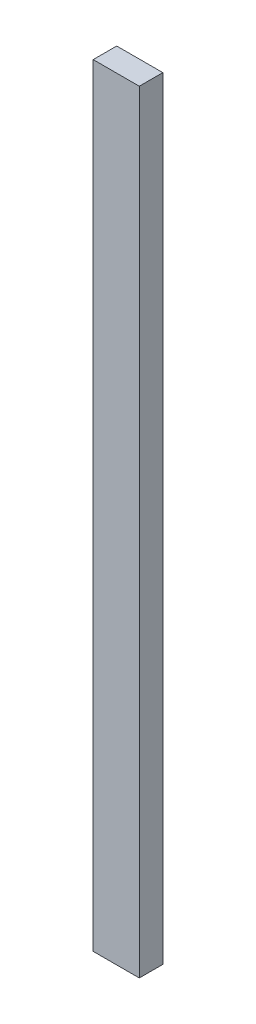
ISO-10303-21;
HEADER;
FILE_DESCRIPTION(('STEP AP214'),'2;1');
FILE_NAME('part.step','',(''),(''),'','','');
FILE_SCHEMA(('AUTOMOTIVE_DESIGN { 1 0 10303 214 1 1 1 1 }'));
ENDSEC;
DATA;
#1=APPLICATION_CONTEXT('core data for automotive mechanical design processes');
#2=APPLICATION_PROTOCOL_DEFINITION('international standard','automotive_design',2000,#1);
#3=PRODUCT_CONTEXT('',#1,'mechanical');
#4=PRODUCT('Part','Part','',(#3));
#5=PRODUCT_RELATED_PRODUCT_CATEGORY('part','',(#4));
#6=PRODUCT_DEFINITION_FORMATION('','',#4);
#7=PRODUCT_DEFINITION_CONTEXT('part definition',#1,'design');
#8=PRODUCT_DEFINITION('design','',#6,#7);
#9=PRODUCT_DEFINITION_SHAPE('','',#8);
#10=(LENGTH_UNIT() NAMED_UNIT(*) SI_UNIT(.MILLI.,.METRE.));
#11=(NAMED_UNIT(*) PLANE_ANGLE_UNIT() SI_UNIT($,.RADIAN.));
#12=(NAMED_UNIT(*) SI_UNIT($,.STERADIAN.) SOLID_ANGLE_UNIT());
#13=UNCERTAINTY_MEASURE_WITH_UNIT(LENGTH_MEASURE(1.E-05),#10,'distance_accuracy_value','');
#14=(GEOMETRIC_REPRESENTATION_CONTEXT(3) GLOBAL_UNCERTAINTY_ASSIGNED_CONTEXT((#13)) GLOBAL_UNIT_ASSIGNED_CONTEXT((#10,
#11,#12)) REPRESENTATION_CONTEXT('',''));
#15=CARTESIAN_POINT('',(0.,0.,0.));
#16=DIRECTION('',(0.,0.,1.));
#17=DIRECTION('',(1.,0.,0.));
#18=AXIS2_PLACEMENT_3D('',#15,#16,#17);
#19=CARTESIAN_POINT('',(-10.27,20.47,328.78));
#20=DIRECTION('',(0.,1.,0.));
#21=DIRECTION('',(0.,0.,1.));
#22=AXIS2_PLACEMENT_3D('',#19,#20,#21);
#23=PLANE('',#22);
#24=DIRECTION('',(0.,0.,1.));
#25=VECTOR('',#24,1.);
#26=CARTESIAN_POINT('',(-261.525,20.47,-328.78));
#27=LINE('',#26,#25);
#28=CARTESIAN_POINT('',(-261.525,20.47,-52.22));
#29=VERTEX_POINT('',#28);
#30=CARTESIAN_POINT('',(-261.525,20.47,-31.75));
#31=VERTEX_POINT('',#30);
#32=EDGE_CURVE('E11',#29,#31,#27,.T.);
#33=ORIENTED_EDGE('',*,*,#32,.T.);
#34=DIRECTION('',(1.,0.,0.));
#35=VECTOR('',#34,1.);
#36=CARTESIAN_POINT('',(-261.525,20.47,-31.75));
#37=LINE('',#36,#35);
#38=CARTESIAN_POINT('',(-301.625,20.47,-31.75));
#39=VERTEX_POINT('',#38);
#40=EDGE_CURVE('E101',#39,#31,#37,.T.);
#41=ORIENTED_EDGE('',*,*,#40,.F.);
#42=DIRECTION('',(0.,0.,1.));
#43=VECTOR('',#42,1.);
#44=CARTESIAN_POINT('',(-301.625,20.47,349.25));
#45=LINE('',#44,#43);
#46=CARTESIAN_POINT('',(-301.625,20.47,-52.22));
#47=VERTEX_POINT('',#46);
#48=EDGE_CURVE('E41',#47,#39,#45,.T.);
#49=ORIENTED_EDGE('',*,*,#48,.F.);
#50=DIRECTION('',(-1.,0.,0.));
#51=VECTOR('',#50,1.);
#52=CARTESIAN_POINT('',(-261.525,20.47,-52.22));
#53=LINE('',#52,#51);
#54=EDGE_CURVE('E47',#29,#47,#53,.T.);
#55=ORIENTED_EDGE('',*,*,#54,.F.);
#56=EDGE_LOOP('',(#33,#41,#49,#55));
#57=FACE_BOUND('',#56,.T.);
#58=ADVANCED_FACE('F34',(#57),#23,.F.);
#59=CARTESIAN_POINT('',(-301.625,20.47,349.25));
#60=DIRECTION('',(1.,0.,0.));
#61=DIRECTION('',(0.,0.,-1.));
#62=AXIS2_PLACEMENT_3D('',#59,#60,#61);
#63=PLANE('',#62);
#64=DIRECTION('',(0.,-1.,0.));
#65=VECTOR('',#64,1.);
#66=CARTESIAN_POINT('',(-301.625,692.15,-52.22));
#67=LINE('',#66,#65);
#68=CARTESIAN_POINT('',(-301.625,692.15,-52.22));
#69=VERTEX_POINT('',#68);
#70=EDGE_CURVE('E98',#69,#47,#67,.T.);
#71=ORIENTED_EDGE('',*,*,#70,.T.);
#72=ORIENTED_EDGE('',*,*,#48,.T.);
#73=DIRECTION('',(0.,-1.,0.));
#74=VECTOR('',#73,1.);
#75=CARTESIAN_POINT('',(-301.625,692.15,-31.75));
#76=LINE('',#75,#74);
#77=CARTESIAN_POINT('',(-301.625,692.15,-31.75));
#78=VERTEX_POINT('',#77);
#79=EDGE_CURVE('E77',#78,#39,#76,.T.);
#80=ORIENTED_EDGE('',*,*,#79,.F.);
#81=DIRECTION('',(0.,0.,1.));
#82=VECTOR('',#81,1.);
#83=CARTESIAN_POINT('',(-301.625,692.15,-52.22));
#84=LINE('',#83,#82);
#85=EDGE_CURVE('E83',#69,#78,#84,.T.);
#86=ORIENTED_EDGE('',*,*,#85,.F.);
#87=EDGE_LOOP('',(#71,#72,#80,#86));
#88=FACE_BOUND('',#87,.T.);
#89=ADVANCED_FACE('F91',(#88),#63,.F.);
#90=CARTESIAN_POINT('',(-261.525,20.47,-328.78));
#91=DIRECTION('',(1.,0.,0.));
#92=DIRECTION('',(0.,0.,-1.));
#93=AXIS2_PLACEMENT_3D('',#90,#91,#92);
#94=PLANE('',#93);
#95=ORIENTED_EDGE('',*,*,#32,.F.);
#96=DIRECTION('',(0.,-1.,0.));
#97=VECTOR('',#96,1.);
#98=CARTESIAN_POINT('',(-261.525,692.15,-52.22));
#99=LINE('',#98,#97);
#100=CARTESIAN_POINT('',(-261.525,692.15,-52.22));
#101=VERTEX_POINT('',#100);
#102=EDGE_CURVE('E93',#101,#29,#99,.T.);
#103=ORIENTED_EDGE('',*,*,#102,.F.);
#104=DIRECTION('',(0.,0.,-1.));
#105=VECTOR('',#104,1.);
#106=CARTESIAN_POINT('',(-261.525,692.15,-52.22));
#107=LINE('',#106,#105);
#108=CARTESIAN_POINT('',(-261.525,692.15,-31.75));
#109=VERTEX_POINT('',#108);
#110=EDGE_CURVE('E82',#109,#101,#107,.T.);
#111=ORIENTED_EDGE('',*,*,#110,.F.);
#112=DIRECTION('',(0.,-1.,0.));
#113=VECTOR('',#112,1.);
#114=CARTESIAN_POINT('',(-261.525,692.15,-31.75));
#115=LINE('',#114,#113);
#116=EDGE_CURVE('E79',#109,#31,#115,.T.);
#117=ORIENTED_EDGE('',*,*,#116,.T.);
#118=EDGE_LOOP('',(#95,#103,#111,#117));
#119=FACE_BOUND('',#118,.T.);
#120=ADVANCED_FACE('F106',(#119),#94,.T.);
#121=CARTESIAN_POINT('',(-261.525,692.15,-31.75));
#122=DIRECTION('',(0.,0.,-1.));
#123=DIRECTION('',(-1.,0.,0.));
#124=AXIS2_PLACEMENT_3D('',#121,#122,#123);
#125=PLANE('',#124);
#126=ORIENTED_EDGE('',*,*,#40,.T.);
#127=ORIENTED_EDGE('',*,*,#116,.F.);
#128=DIRECTION('',(1.,0.,0.));
#129=VECTOR('',#128,1.);
#130=CARTESIAN_POINT('',(-261.525,692.15,-31.75));
#131=LINE('',#130,#129);
#132=EDGE_CURVE('E74',#78,#109,#131,.T.);
#133=ORIENTED_EDGE('',*,*,#132,.F.);
#134=ORIENTED_EDGE('',*,*,#79,.T.);
#135=EDGE_LOOP('',(#126,#127,#133,#134));
#136=FACE_BOUND('',#135,.T.);
#137=ADVANCED_FACE('F76',(#136),#125,.F.);
#138=CARTESIAN_POINT('',(-261.525,692.15,-52.22));
#139=DIRECTION('',(0.,0.,1.));
#140=DIRECTION('',(1.,0.,0.));
#141=AXIS2_PLACEMENT_3D('',#138,#139,#140);
#142=PLANE('',#141);
#143=ORIENTED_EDGE('',*,*,#54,.T.);
#144=ORIENTED_EDGE('',*,*,#70,.F.);
#145=DIRECTION('',(-1.,0.,0.));
#146=VECTOR('',#145,1.);
#147=CARTESIAN_POINT('',(-261.525,692.15,-52.22));
#148=LINE('',#147,#146);
#149=EDGE_CURVE('E88',#101,#69,#148,.T.);
#150=ORIENTED_EDGE('',*,*,#149,.F.);
#151=ORIENTED_EDGE('',*,*,#102,.T.);
#152=EDGE_LOOP('',(#143,#144,#150,#151));
#153=FACE_BOUND('',#152,.T.);
#154=ADVANCED_FACE('F108',(#153),#142,.F.);
#155=CARTESIAN_POINT('',(0.,692.15,0.));
#156=DIRECTION('',(0.,-1.,0.));
#157=DIRECTION('',(0.,0.,-1.));
#158=AXIS2_PLACEMENT_3D('',#155,#156,#157);
#159=PLANE('',#158);
#160=ORIENTED_EDGE('',*,*,#85,.T.);
#161=ORIENTED_EDGE('',*,*,#132,.T.);
#162=ORIENTED_EDGE('',*,*,#110,.T.);
#163=ORIENTED_EDGE('',*,*,#149,.T.);
#164=EDGE_LOOP('',(#160,#161,#162,#163));
#165=FACE_BOUND('',#164,.T.);
#166=ADVANCED_FACE('F86',(#165),#159,.F.);
#167=CLOSED_SHELL('',(#58,#89,#120,#137,#154,#166));
#168=MANIFOLD_SOLID_BREP('B2',#167);
#169=ADVANCED_BREP_SHAPE_REPRESENTATION('',(#18,#168),#14);
#170=SHAPE_DEFINITION_REPRESENTATION(#9,#169);
ENDSEC;
END-ISO-10303-21;
